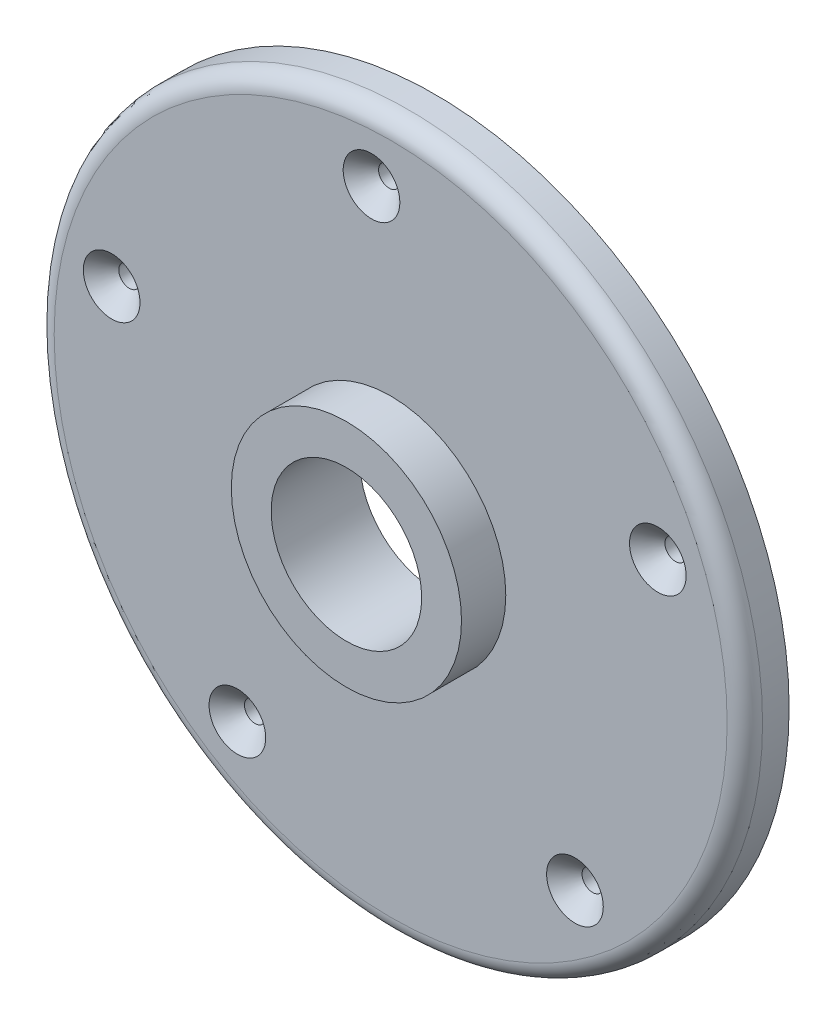
ISO-10303-21;
HEADER;
FILE_DESCRIPTION(('STEP AP214'),'2;1');
FILE_NAME('part.step','',(''),(''),'','','');
FILE_SCHEMA(('AUTOMOTIVE_DESIGN { 1 0 10303 214 1 1 1 1 }'));
ENDSEC;
DATA;
#1=APPLICATION_CONTEXT('core data for automotive mechanical design processes');
#2=APPLICATION_PROTOCOL_DEFINITION('international standard','automotive_design',2000,#1);
#3=PRODUCT_CONTEXT('',#1,'mechanical');
#4=PRODUCT('Part','Part','',(#3));
#5=PRODUCT_RELATED_PRODUCT_CATEGORY('part','',(#4));
#6=PRODUCT_DEFINITION_FORMATION('','',#4);
#7=PRODUCT_DEFINITION_CONTEXT('part definition',#1,'design');
#8=PRODUCT_DEFINITION('design','',#6,#7);
#9=PRODUCT_DEFINITION_SHAPE('','',#8);
#10=(LENGTH_UNIT() NAMED_UNIT(*) SI_UNIT(.MILLI.,.METRE.));
#11=(NAMED_UNIT(*) PLANE_ANGLE_UNIT() SI_UNIT($,.RADIAN.));
#12=(NAMED_UNIT(*) SI_UNIT($,.STERADIAN.) SOLID_ANGLE_UNIT());
#13=UNCERTAINTY_MEASURE_WITH_UNIT(LENGTH_MEASURE(1.E-05),#10,'distance_accuracy_value','');
#14=(GEOMETRIC_REPRESENTATION_CONTEXT(3) GLOBAL_UNCERTAINTY_ASSIGNED_CONTEXT((#13)) GLOBAL_UNIT_ASSIGNED_CONTEXT((#10,
#11,#12)) REPRESENTATION_CONTEXT('',''));
#15=CARTESIAN_POINT('',(0.,0.,0.));
#16=DIRECTION('',(0.,0.,1.));
#17=DIRECTION('',(1.,0.,0.));
#18=AXIS2_PLACEMENT_3D('',#15,#16,#17);
#19=CARTESIAN_POINT('',(0.,0.,2.5));
#20=DIRECTION('',(0.,0.,1.));
#21=DIRECTION('',(1.,0.,0.));
#22=AXIS2_PLACEMENT_3D('',#19,#20,#21);
#23=PLANE('',#22);
#24=CARTESIAN_POINT('',(0.,0.,2.5));
#25=DIRECTION('',(0.,0.,1.));
#26=DIRECTION('',(1.,0.,0.));
#27=AXIS2_PLACEMENT_3D('',#24,#25,#26);
#28=CIRCLE('',#27,38.);
#29=CARTESIAN_POINT('',(38.,0.,2.5));
#30=VERTEX_POINT('',#29);
#31=EDGE_CURVE('E38',#30,#30,#28,.T.);
#32=ORIENTED_EDGE('',*,*,#31,.T.);
#33=EDGE_LOOP('',(#32));
#34=FACE_BOUND('',#33,.T.);
#35=CARTESIAN_POINT('',(-2.1627854626808,32.4279564425885,2.5));
#36=DIRECTION('',(0.,0.,1.));
#37=DIRECTION('',(1.,0.,0.));
#38=AXIS2_PLACEMENT_3D('',#35,#36,#37);
#39=CIRCLE('',#38,3.2);
#40=CARTESIAN_POINT('',(1.0372145373192,32.4279564425885,2.5));
#41=VERTEX_POINT('',#40);
#42=EDGE_CURVE('E57',#41,#41,#39,.T.);
#43=ORIENTED_EDGE('',*,*,#42,.F.);
#44=EDGE_LOOP('',(#43));
#45=FACE_BOUND('',#44,.T.);
#46=CARTESIAN_POINT('',(30.1724818217038,12.0777208412413,2.5));
#47=DIRECTION('',(0.,0.,1.));
#48=DIRECTION('',(1.,0.,0.));
#49=AXIS2_PLACEMENT_3D('',#46,#47,#48);
#50=CIRCLE('',#49,3.2);
#51=CARTESIAN_POINT('',(33.3724818217038,12.0777208412413,2.5));
#52=VERTEX_POINT('',#51);
#53=EDGE_CURVE('E69',#52,#52,#50,.T.);
#54=ORIENTED_EDGE('',*,*,#53,.F.);
#55=EDGE_LOOP('',(#54));
#56=FACE_BOUND('',#55,.T.);
#57=CARTESIAN_POINT('',(20.8104047534319,-24.9635144560684,2.5));
#58=DIRECTION('',(0.,0.,1.));
#59=DIRECTION('',(1.,0.,0.));
#60=AXIS2_PLACEMENT_3D('',#57,#58,#59);
#61=CIRCLE('',#60,3.2);
#62=CARTESIAN_POINT('',(24.0104047534319,-24.9635144560684,2.5));
#63=VERTEX_POINT('',#62);
#64=EDGE_CURVE('E81',#63,#63,#61,.T.);
#65=ORIENTED_EDGE('',*,*,#64,.F.);
#66=EDGE_LOOP('',(#65));
#67=FACE_BOUND('',#66,.T.);
#68=CARTESIAN_POINT('',(-17.3109443644406,-27.5060212537408,2.5));
#69=DIRECTION('',(0.,0.,1.));
#70=DIRECTION('',(1.,0.,0.));
#71=AXIS2_PLACEMENT_3D('',#68,#69,#70);
#72=CIRCLE('',#71,3.2);
#73=CARTESIAN_POINT('',(-14.1109443644406,-27.5060212537408,2.5));
#74=VERTEX_POINT('',#73);
#75=EDGE_CURVE('E93',#74,#74,#72,.T.);
#76=ORIENTED_EDGE('',*,*,#75,.F.);
#77=EDGE_LOOP('',(#76));
#78=FACE_BOUND('',#77,.T.);
#79=CARTESIAN_POINT('',(-31.5091567480146,7.96385842597976,2.5));
#80=DIRECTION('',(0.,0.,1.));
#81=DIRECTION('',(1.,0.,0.));
#82=AXIS2_PLACEMENT_3D('',#79,#80,#81);
#83=CIRCLE('',#82,3.2);
#84=CARTESIAN_POINT('',(-28.3091567480146,7.96385842597976,2.5));
#85=VERTEX_POINT('',#84);
#86=EDGE_CURVE('E105',#85,#85,#83,.T.);
#87=ORIENTED_EDGE('',*,*,#86,.F.);
#88=EDGE_LOOP('',(#87));
#89=FACE_BOUND('',#88,.T.);
#90=CARTESIAN_POINT('',(0.,0.,2.5));
#91=DIRECTION('',(0.,0.,1.));
#92=DIRECTION('',(1.,0.,0.));
#93=AXIS2_PLACEMENT_3D('',#90,#91,#92);
#94=CIRCLE('',#93,13.);
#95=CARTESIAN_POINT('',(13.,0.,2.5));
#96=VERTEX_POINT('',#95);
#97=EDGE_CURVE('E112',#96,#96,#94,.T.);
#98=ORIENTED_EDGE('',*,*,#97,.F.);
#99=EDGE_LOOP('',(#98));
#100=FACE_BOUND('',#99,.T.);
#101=ADVANCED_FACE('F31',(#34,#45,#56,#67,#78,#89,#100),#23,.T.);
#102=CARTESIAN_POINT('',(0.,0.,-2.5));
#103=DIRECTION('',(0.,0.,1.));
#104=DIRECTION('',(1.,0.,0.));
#105=AXIS2_PLACEMENT_3D('',#102,#103,#104);
#106=PLANE('',#105);
#107=CARTESIAN_POINT('',(-31.5091567480146,7.96385842597976,-2.5));
#108=DIRECTION('',(0.,0.,1.));
#109=DIRECTION('',(1.,0.,0.));
#110=AXIS2_PLACEMENT_3D('',#107,#108,#109);
#111=CIRCLE('',#110,1.225);
#112=CARTESIAN_POINT('',(-30.2841567480146,7.96385842597976,-2.5));
#113=VERTEX_POINT('',#112);
#114=EDGE_CURVE('E108',#113,#113,#111,.T.);
#115=ORIENTED_EDGE('',*,*,#114,.T.);
#116=EDGE_LOOP('',(#115));
#117=FACE_BOUND('',#116,.T.);
#118=CARTESIAN_POINT('',(-17.3109443644406,-27.5060212537408,-2.5));
#119=DIRECTION('',(0.,0.,1.));
#120=DIRECTION('',(1.,0.,0.));
#121=AXIS2_PLACEMENT_3D('',#118,#119,#120);
#122=CIRCLE('',#121,1.225);
#123=CARTESIAN_POINT('',(-16.0859443644406,-27.5060212537408,-2.5));
#124=VERTEX_POINT('',#123);
#125=EDGE_CURVE('E96',#124,#124,#122,.T.);
#126=ORIENTED_EDGE('',*,*,#125,.T.);
#127=EDGE_LOOP('',(#126));
#128=FACE_BOUND('',#127,.T.);
#129=CARTESIAN_POINT('',(20.8104047534319,-24.9635144560684,-2.5));
#130=DIRECTION('',(0.,0.,1.));
#131=DIRECTION('',(1.,0.,0.));
#132=AXIS2_PLACEMENT_3D('',#129,#130,#131);
#133=CIRCLE('',#132,1.225);
#134=CARTESIAN_POINT('',(22.0354047534319,-24.9635144560684,-2.5));
#135=VERTEX_POINT('',#134);
#136=EDGE_CURVE('E84',#135,#135,#133,.T.);
#137=ORIENTED_EDGE('',*,*,#136,.T.);
#138=EDGE_LOOP('',(#137));
#139=FACE_BOUND('',#138,.T.);
#140=CARTESIAN_POINT('',(30.1724818217038,12.0777208412413,-2.5));
#141=DIRECTION('',(0.,0.,1.));
#142=DIRECTION('',(1.,0.,0.));
#143=AXIS2_PLACEMENT_3D('',#140,#141,#142);
#144=CIRCLE('',#143,1.225);
#145=CARTESIAN_POINT('',(31.3974818217038,12.0777208412413,-2.5));
#146=VERTEX_POINT('',#145);
#147=EDGE_CURVE('E72',#146,#146,#144,.T.);
#148=ORIENTED_EDGE('',*,*,#147,.T.);
#149=EDGE_LOOP('',(#148));
#150=FACE_BOUND('',#149,.T.);
#151=CARTESIAN_POINT('',(-2.1627854626808,32.4279564425885,-2.5));
#152=DIRECTION('',(0.,0.,1.));
#153=DIRECTION('',(1.,0.,0.));
#154=AXIS2_PLACEMENT_3D('',#151,#152,#153);
#155=CIRCLE('',#154,1.225);
#156=CARTESIAN_POINT('',(-0.937785462680803,32.4279564425885,-2.5));
#157=VERTEX_POINT('',#156);
#158=EDGE_CURVE('E60',#157,#157,#155,.T.);
#159=ORIENTED_EDGE('',*,*,#158,.T.);
#160=EDGE_LOOP('',(#159));
#161=FACE_BOUND('',#160,.T.);
#162=CARTESIAN_POINT('',(0.,0.,-2.5));
#163=DIRECTION('',(0.,0.,1.));
#164=DIRECTION('',(1.,0.,0.));
#165=AXIS2_PLACEMENT_3D('',#162,#163,#164);
#166=CIRCLE('',#165,40.);
#167=CARTESIAN_POINT('',(40.,0.,-2.5));
#168=VERTEX_POINT('',#167);
#169=EDGE_CURVE('E42',#168,#168,#166,.T.);
#170=ORIENTED_EDGE('',*,*,#169,.F.);
#171=EDGE_LOOP('',(#170));
#172=FACE_BOUND('',#171,.T.);
#173=CARTESIAN_POINT('',(0.,0.,-2.5));
#174=DIRECTION('',(0.,0.,1.));
#175=DIRECTION('',(1.,0.,0.));
#176=AXIS2_PLACEMENT_3D('',#173,#174,#175);
#177=CIRCLE('',#176,8.5);
#178=CARTESIAN_POINT('',(8.5,0.,-2.5));
#179=VERTEX_POINT('',#178);
#180=EDGE_CURVE('E46',#179,#179,#177,.T.);
#181=ORIENTED_EDGE('',*,*,#180,.T.);
#182=EDGE_LOOP('',(#181));
#183=FACE_BOUND('',#182,.T.);
#184=ADVANCED_FACE('F140',(#117,#128,#139,#150,#161,#172,#183),#106,.F.);
#185=CARTESIAN_POINT('',(0.,0.,2.5));
#186=DIRECTION('',(0.,0.,-1.));
#187=DIRECTION('',(-1.,0.,0.));
#188=AXIS2_PLACEMENT_3D('',#185,#186,#187);
#189=CYLINDRICAL_SURFACE('',#188,40.);
#190=CARTESIAN_POINT('',(0.,0.,0.5));
#191=DIRECTION('',(0.,0.,1.));
#192=DIRECTION('',(1.,0.,0.));
#193=AXIS2_PLACEMENT_3D('',#190,#191,#192);
#194=CIRCLE('',#193,40.);
#195=CARTESIAN_POINT('',(40.,0.,0.5));
#196=VERTEX_POINT('',#195);
#197=EDGE_CURVE('E10',#196,#196,#194,.F.);
#198=ORIENTED_EDGE('',*,*,#197,.T.);
#199=EDGE_LOOP('',(#198));
#200=FACE_BOUND('',#199,.T.);
#201=ORIENTED_EDGE('',*,*,#169,.T.);
#202=EDGE_LOOP('',(#201));
#203=FACE_BOUND('',#202,.T.);
#204=ADVANCED_FACE('F147',(#200,#203),#189,.T.);
#205=CARTESIAN_POINT('',(0.,0.,2.5));
#206=DIRECTION('',(0.,0.,-1.));
#207=DIRECTION('',(-1.,0.,0.));
#208=AXIS2_PLACEMENT_3D('',#205,#206,#207);
#209=CYLINDRICAL_SURFACE('',#208,8.5);
#210=ORIENTED_EDGE('',*,*,#180,.F.);
#211=EDGE_LOOP('',(#210));
#212=FACE_BOUND('',#211,.T.);
#213=CARTESIAN_POINT('',(0.,0.,7.5));
#214=DIRECTION('',(0.,0.,1.));
#215=DIRECTION('',(1.,0.,0.));
#216=AXIS2_PLACEMENT_3D('',#213,#214,#215);
#217=CIRCLE('',#216,8.5);
#218=CARTESIAN_POINT('',(8.5,0.,7.5));
#219=VERTEX_POINT('',#218);
#220=EDGE_CURVE('E115',#219,#219,#217,.T.);
#221=ORIENTED_EDGE('',*,*,#220,.T.);
#222=EDGE_LOOP('',(#221));
#223=FACE_BOUND('',#222,.T.);
#224=ADVANCED_FACE('F121',(#212,#223),#209,.F.);
#225=CARTESIAN_POINT('',(0.,0.,0.5));
#226=DIRECTION('',(0.,0.,1.));
#227=DIRECTION('',(1.,0.,0.));
#228=AXIS2_PLACEMENT_3D('',#225,#226,#227);
#229=TOROIDAL_SURFACE('',#228,38.,2.);
#230=ORIENTED_EDGE('',*,*,#197,.F.);
#231=EDGE_LOOP('',(#230));
#232=FACE_BOUND('',#231,.T.);
#233=ORIENTED_EDGE('',*,*,#31,.F.);
#234=EDGE_LOOP('',(#233));
#235=FACE_BOUND('',#234,.T.);
#236=ADVANCED_FACE('F33',(#232,#235),#229,.T.);
#237=CARTESIAN_POINT('',(-2.1627854626808,32.4279564425885,-2.475));
#238=DIRECTION('',(0.,0.,-1.));
#239=DIRECTION('',(-1.,0.,0.));
#240=AXIS2_PLACEMENT_3D('',#237,#238,#239);
#241=CONICAL_SURFACE('',#240,1.2,0.785398163397487);
#242=ORIENTED_EDGE('',*,*,#158,.F.);
#243=EDGE_LOOP('',(#242));
#244=FACE_BOUND('',#243,.T.);
#245=CARTESIAN_POINT('',(-2.1627854626808,32.4279564425885,-2.475));
#246=DIRECTION('',(0.,0.,1.));
#247=DIRECTION('',(1.,0.,0.));
#248=AXIS2_PLACEMENT_3D('',#245,#246,#247);
#249=CIRCLE('',#248,1.2);
#250=CARTESIAN_POINT('',(-0.962785462680805,32.4279564425885,-2.475));
#251=VERTEX_POINT('',#250);
#252=EDGE_CURVE('E51',#251,#251,#249,.T.);
#253=ORIENTED_EDGE('',*,*,#252,.T.);
#254=EDGE_LOOP('',(#253));
#255=FACE_BOUND('',#254,.T.);
#256=ADVANCED_FACE('F165',(#244,#255),#241,.F.);
#257=CARTESIAN_POINT('',(-2.1627854626808,32.4279564425885,2.5));
#258=DIRECTION('',(0.,0.,1.));
#259=DIRECTION('',(1.,0.,0.));
#260=AXIS2_PLACEMENT_3D('',#257,#258,#259);
#261=CYLINDRICAL_SURFACE('',#260,1.2);
#262=ORIENTED_EDGE('',*,*,#252,.F.);
#263=EDGE_LOOP('',(#262));
#264=FACE_BOUND('',#263,.T.);
#265=CARTESIAN_POINT('',(-2.1627854626808,32.4279564425885,0.500000000000001));
#266=DIRECTION('',(0.,0.,1.));
#267=DIRECTION('',(1.,0.,0.));
#268=AXIS2_PLACEMENT_3D('',#265,#266,#267);
#269=CIRCLE('',#268,1.2);
#270=CARTESIAN_POINT('',(-0.962785462680804,32.4279564425885,0.500000000000001));
#271=VERTEX_POINT('',#270);
#272=EDGE_CURVE('E54',#271,#271,#269,.T.);
#273=ORIENTED_EDGE('',*,*,#272,.T.);
#274=EDGE_LOOP('',(#273));
#275=FACE_BOUND('',#274,.T.);
#276=ADVANCED_FACE('F170',(#264,#275),#261,.F.);
#277=CARTESIAN_POINT('',(-2.1627854626808,32.4279564425885,2.5));
#278=DIRECTION('',(0.,0.,1.));
#279=DIRECTION('',(1.,0.,0.));
#280=AXIS2_PLACEMENT_3D('',#277,#278,#279);
#281=CONICAL_SURFACE('',#280,3.2,0.785398163397448);
#282=ORIENTED_EDGE('',*,*,#272,.F.);
#283=EDGE_LOOP('',(#282));
#284=FACE_BOUND('',#283,.T.);
#285=ORIENTED_EDGE('',*,*,#42,.T.);
#286=EDGE_LOOP('',(#285));
#287=FACE_BOUND('',#286,.T.);
#288=ADVANCED_FACE('F176',(#284,#287),#281,.F.);
#289=CARTESIAN_POINT('',(30.1724818217038,12.0777208412413,-2.475));
#290=DIRECTION('',(0.,0.,-1.));
#291=DIRECTION('',(-1.,0.,0.));
#292=AXIS2_PLACEMENT_3D('',#289,#290,#291);
#293=CONICAL_SURFACE('',#292,1.2,0.785398163397396);
#294=ORIENTED_EDGE('',*,*,#147,.F.);
#295=EDGE_LOOP('',(#294));
#296=FACE_BOUND('',#295,.T.);
#297=CARTESIAN_POINT('',(30.1724818217038,12.0777208412413,-2.475));
#298=DIRECTION('',(0.,0.,1.));
#299=DIRECTION('',(1.,0.,0.));
#300=AXIS2_PLACEMENT_3D('',#297,#298,#299);
#301=CIRCLE('',#300,1.2);
#302=CARTESIAN_POINT('',(31.3724818217038,12.0777208412413,-2.475));
#303=VERTEX_POINT('',#302);
#304=EDGE_CURVE('E63',#303,#303,#301,.T.);
#305=ORIENTED_EDGE('',*,*,#304,.T.);
#306=EDGE_LOOP('',(#305));
#307=FACE_BOUND('',#306,.T.);
#308=ADVANCED_FACE('F184',(#296,#307),#293,.F.);
#309=CARTESIAN_POINT('',(30.1724818217038,12.0777208412413,2.5));
#310=DIRECTION('',(0.,0.,1.));
#311=DIRECTION('',(1.,0.,0.));
#312=AXIS2_PLACEMENT_3D('',#309,#310,#311);
#313=CYLINDRICAL_SURFACE('',#312,1.2);
#314=ORIENTED_EDGE('',*,*,#304,.F.);
#315=EDGE_LOOP('',(#314));
#316=FACE_BOUND('',#315,.T.);
#317=CARTESIAN_POINT('',(30.1724818217038,12.0777208412413,0.500000000000001));
#318=DIRECTION('',(0.,0.,1.));
#319=DIRECTION('',(1.,0.,0.));
#320=AXIS2_PLACEMENT_3D('',#317,#318,#319);
#321=CIRCLE('',#320,1.2);
#322=CARTESIAN_POINT('',(31.3724818217038,12.0777208412413,0.500000000000001));
#323=VERTEX_POINT('',#322);
#324=EDGE_CURVE('E66',#323,#323,#321,.T.);
#325=ORIENTED_EDGE('',*,*,#324,.T.);
#326=EDGE_LOOP('',(#325));
#327=FACE_BOUND('',#326,.T.);
#328=ADVANCED_FACE('F188',(#316,#327),#313,.F.);
#329=CARTESIAN_POINT('',(30.1724818217038,12.0777208412413,2.5));
#330=DIRECTION('',(0.,0.,1.));
#331=DIRECTION('',(1.,0.,0.));
#332=AXIS2_PLACEMENT_3D('',#329,#330,#331);
#333=CONICAL_SURFACE('',#332,3.2,0.785398163397449);
#334=ORIENTED_EDGE('',*,*,#324,.F.);
#335=EDGE_LOOP('',(#334));
#336=FACE_BOUND('',#335,.T.);
#337=ORIENTED_EDGE('',*,*,#53,.T.);
#338=EDGE_LOOP('',(#337));
#339=FACE_BOUND('',#338,.T.);
#340=ADVANCED_FACE('F192',(#336,#339),#333,.F.);
#341=CARTESIAN_POINT('',(20.8104047534319,-24.9635144560684,-2.475));
#342=DIRECTION('',(0.,0.,-1.));
#343=DIRECTION('',(-1.,0.,0.));
#344=AXIS2_PLACEMENT_3D('',#341,#342,#343);
#345=CONICAL_SURFACE('',#344,1.2,0.785398163397466);
#346=ORIENTED_EDGE('',*,*,#136,.F.);
#347=EDGE_LOOP('',(#346));
#348=FACE_BOUND('',#347,.T.);
#349=CARTESIAN_POINT('',(20.8104047534319,-24.9635144560684,-2.475));
#350=DIRECTION('',(0.,0.,1.));
#351=DIRECTION('',(1.,0.,0.));
#352=AXIS2_PLACEMENT_3D('',#349,#350,#351);
#353=CIRCLE('',#352,1.2);
#354=CARTESIAN_POINT('',(22.0104047534319,-24.9635144560684,-2.475));
#355=VERTEX_POINT('',#354);
#356=EDGE_CURVE('E75',#355,#355,#353,.T.);
#357=ORIENTED_EDGE('',*,*,#356,.T.);
#358=EDGE_LOOP('',(#357));
#359=FACE_BOUND('',#358,.T.);
#360=ADVANCED_FACE('F196',(#348,#359),#345,.F.);
#361=CARTESIAN_POINT('',(20.8104047534319,-24.9635144560684,2.5));
#362=DIRECTION('',(0.,0.,1.));
#363=DIRECTION('',(1.,0.,0.));
#364=AXIS2_PLACEMENT_3D('',#361,#362,#363);
#365=CYLINDRICAL_SURFACE('',#364,1.2);
#366=ORIENTED_EDGE('',*,*,#356,.F.);
#367=EDGE_LOOP('',(#366));
#368=FACE_BOUND('',#367,.T.);
#369=CARTESIAN_POINT('',(20.8104047534319,-24.9635144560684,0.500000000000001));
#370=DIRECTION('',(0.,0.,1.));
#371=DIRECTION('',(1.,0.,0.));
#372=AXIS2_PLACEMENT_3D('',#369,#370,#371);
#373=CIRCLE('',#372,1.2);
#374=CARTESIAN_POINT('',(22.0104047534319,-24.9635144560684,0.500000000000001));
#375=VERTEX_POINT('',#374);
#376=EDGE_CURVE('E78',#375,#375,#373,.T.);
#377=ORIENTED_EDGE('',*,*,#376,.T.);
#378=EDGE_LOOP('',(#377));
#379=FACE_BOUND('',#378,.T.);
#380=ADVANCED_FACE('F200',(#368,#379),#365,.F.);
#381=CARTESIAN_POINT('',(20.8104047534319,-24.9635144560684,2.5));
#382=DIRECTION('',(0.,0.,1.));
#383=DIRECTION('',(1.,0.,0.));
#384=AXIS2_PLACEMENT_3D('',#381,#382,#383);
#385=CONICAL_SURFACE('',#384,3.2,0.785398163397448);
#386=ORIENTED_EDGE('',*,*,#376,.F.);
#387=EDGE_LOOP('',(#386));
#388=FACE_BOUND('',#387,.T.);
#389=ORIENTED_EDGE('',*,*,#64,.T.);
#390=EDGE_LOOP('',(#389));
#391=FACE_BOUND('',#390,.T.);
#392=ADVANCED_FACE('F204',(#388,#391),#385,.F.);
#393=CARTESIAN_POINT('',(-17.3109443644406,-27.5060212537408,-2.475));
#394=DIRECTION('',(0.,0.,-1.));
#395=DIRECTION('',(-1.,0.,0.));
#396=AXIS2_PLACEMENT_3D('',#393,#394,#395);
#397=CONICAL_SURFACE('',#396,1.2,0.785398163397466);
#398=ORIENTED_EDGE('',*,*,#125,.F.);
#399=EDGE_LOOP('',(#398));
#400=FACE_BOUND('',#399,.T.);
#401=CARTESIAN_POINT('',(-17.3109443644406,-27.5060212537408,-2.475));
#402=DIRECTION('',(0.,0.,1.));
#403=DIRECTION('',(1.,0.,0.));
#404=AXIS2_PLACEMENT_3D('',#401,#402,#403);
#405=CIRCLE('',#404,1.2);
#406=CARTESIAN_POINT('',(-16.1109443644406,-27.5060212537408,-2.475));
#407=VERTEX_POINT('',#406);
#408=EDGE_CURVE('E87',#407,#407,#405,.T.);
#409=ORIENTED_EDGE('',*,*,#408,.T.);
#410=EDGE_LOOP('',(#409));
#411=FACE_BOUND('',#410,.T.);
#412=ADVANCED_FACE('F208',(#400,#411),#397,.F.);
#413=CARTESIAN_POINT('',(-17.3109443644406,-27.5060212537408,2.5));
#414=DIRECTION('',(0.,0.,1.));
#415=DIRECTION('',(1.,0.,0.));
#416=AXIS2_PLACEMENT_3D('',#413,#414,#415);
#417=CYLINDRICAL_SURFACE('',#416,1.2);
#418=ORIENTED_EDGE('',*,*,#408,.F.);
#419=EDGE_LOOP('',(#418));
#420=FACE_BOUND('',#419,.T.);
#421=CARTESIAN_POINT('',(-17.3109443644406,-27.5060212537408,0.500000000000001));
#422=DIRECTION('',(0.,0.,1.));
#423=DIRECTION('',(1.,0.,0.));
#424=AXIS2_PLACEMENT_3D('',#421,#422,#423);
#425=CIRCLE('',#424,1.2);
#426=CARTESIAN_POINT('',(-16.1109443644406,-27.5060212537408,0.500000000000001));
#427=VERTEX_POINT('',#426);
#428=EDGE_CURVE('E90',#427,#427,#425,.T.);
#429=ORIENTED_EDGE('',*,*,#428,.T.);
#430=EDGE_LOOP('',(#429));
#431=FACE_BOUND('',#430,.T.);
#432=ADVANCED_FACE('F212',(#420,#431),#417,.F.);
#433=CARTESIAN_POINT('',(-17.3109443644406,-27.5060212537408,2.5));
#434=DIRECTION('',(0.,0.,1.));
#435=DIRECTION('',(1.,0.,0.));
#436=AXIS2_PLACEMENT_3D('',#433,#434,#435);
#437=CONICAL_SURFACE('',#436,3.2,0.785398163397448);
#438=ORIENTED_EDGE('',*,*,#428,.F.);
#439=EDGE_LOOP('',(#438));
#440=FACE_BOUND('',#439,.T.);
#441=ORIENTED_EDGE('',*,*,#75,.T.);
#442=EDGE_LOOP('',(#441));
#443=FACE_BOUND('',#442,.T.);
#444=ADVANCED_FACE('F216',(#440,#443),#437,.F.);
#445=CARTESIAN_POINT('',(-31.5091567480146,7.96385842597976,-2.475));
#446=DIRECTION('',(0.,0.,-1.));
#447=DIRECTION('',(-1.,0.,0.));
#448=AXIS2_PLACEMENT_3D('',#445,#446,#447);
#449=CONICAL_SURFACE('',#448,1.2,0.785398163397466);
#450=ORIENTED_EDGE('',*,*,#114,.F.);
#451=EDGE_LOOP('',(#450));
#452=FACE_BOUND('',#451,.T.);
#453=CARTESIAN_POINT('',(-31.5091567480146,7.96385842597976,-2.475));
#454=DIRECTION('',(0.,0.,1.));
#455=DIRECTION('',(1.,0.,0.));
#456=AXIS2_PLACEMENT_3D('',#453,#454,#455);
#457=CIRCLE('',#456,1.2);
#458=CARTESIAN_POINT('',(-30.3091567480146,7.96385842597976,-2.475));
#459=VERTEX_POINT('',#458);
#460=EDGE_CURVE('E99',#459,#459,#457,.T.);
#461=ORIENTED_EDGE('',*,*,#460,.T.);
#462=EDGE_LOOP('',(#461));
#463=FACE_BOUND('',#462,.T.);
#464=ADVANCED_FACE('F220',(#452,#463),#449,.F.);
#465=CARTESIAN_POINT('',(-31.5091567480146,7.96385842597976,2.5));
#466=DIRECTION('',(0.,0.,1.));
#467=DIRECTION('',(1.,0.,0.));
#468=AXIS2_PLACEMENT_3D('',#465,#466,#467);
#469=CYLINDRICAL_SURFACE('',#468,1.2);
#470=ORIENTED_EDGE('',*,*,#460,.F.);
#471=EDGE_LOOP('',(#470));
#472=FACE_BOUND('',#471,.T.);
#473=CARTESIAN_POINT('',(-31.5091567480146,7.96385842597976,0.500000000000001));
#474=DIRECTION('',(0.,0.,1.));
#475=DIRECTION('',(1.,0.,0.));
#476=AXIS2_PLACEMENT_3D('',#473,#474,#475);
#477=CIRCLE('',#476,1.2);
#478=CARTESIAN_POINT('',(-30.3091567480146,7.96385842597976,0.500000000000001));
#479=VERTEX_POINT('',#478);
#480=EDGE_CURVE('E102',#479,#479,#477,.T.);
#481=ORIENTED_EDGE('',*,*,#480,.T.);
#482=EDGE_LOOP('',(#481));
#483=FACE_BOUND('',#482,.T.);
#484=ADVANCED_FACE('F136',(#472,#483),#469,.F.);
#485=CARTESIAN_POINT('',(-31.5091567480146,7.96385842597976,2.5));
#486=DIRECTION('',(0.,0.,1.));
#487=DIRECTION('',(1.,0.,0.));
#488=AXIS2_PLACEMENT_3D('',#485,#486,#487);
#489=CONICAL_SURFACE('',#488,3.2,0.785398163397449);
#490=ORIENTED_EDGE('',*,*,#480,.F.);
#491=EDGE_LOOP('',(#490));
#492=FACE_BOUND('',#491,.T.);
#493=ORIENTED_EDGE('',*,*,#86,.T.);
#494=EDGE_LOOP('',(#493));
#495=FACE_BOUND('',#494,.T.);
#496=ADVANCED_FACE('F126',(#492,#495),#489,.F.);
#497=CARTESIAN_POINT('',(0.,0.,7.5));
#498=DIRECTION('',(0.,0.,1.));
#499=DIRECTION('',(1.,0.,0.));
#500=AXIS2_PLACEMENT_3D('',#497,#498,#499);
#501=PLANE('',#500);
#502=CARTESIAN_POINT('',(0.,0.,7.5));
#503=DIRECTION('',(0.,0.,1.));
#504=DIRECTION('',(1.,0.,0.));
#505=AXIS2_PLACEMENT_3D('',#502,#503,#504);
#506=CIRCLE('',#505,13.);
#507=CARTESIAN_POINT('',(13.,0.,7.5));
#508=VERTEX_POINT('',#507);
#509=EDGE_CURVE('E111',#508,#508,#506,.T.);
#510=ORIENTED_EDGE('',*,*,#509,.T.);
#511=EDGE_LOOP('',(#510));
#512=FACE_BOUND('',#511,.T.);
#513=ORIENTED_EDGE('',*,*,#220,.F.);
#514=EDGE_LOOP('',(#513));
#515=FACE_BOUND('',#514,.T.);
#516=ADVANCED_FACE('F123',(#512,#515),#501,.T.);
#517=CARTESIAN_POINT('',(0.,0.,7.5));
#518=DIRECTION('',(0.,0.,-1.));
#519=DIRECTION('',(-1.,0.,0.));
#520=AXIS2_PLACEMENT_3D('',#517,#518,#519);
#521=CYLINDRICAL_SURFACE('',#520,13.);
#522=ORIENTED_EDGE('',*,*,#509,.F.);
#523=EDGE_LOOP('',(#522));
#524=FACE_BOUND('',#523,.T.);
#525=ORIENTED_EDGE('',*,*,#97,.T.);
#526=EDGE_LOOP('',(#525));
#527=FACE_BOUND('',#526,.T.);
#528=ADVANCED_FACE('F125',(#524,#527),#521,.T.);
#529=CLOSED_SHELL('',(#101,#184,#204,#224,#236,#256,#276,#288,#308,#328,#340,#360,#380,#392,
#412,#432,#444,#464,#484,#496,#516,#528));
#530=MANIFOLD_SOLID_BREP('B2',#529);
#531=ADVANCED_BREP_SHAPE_REPRESENTATION('',(#18,#530),#14);
#532=SHAPE_DEFINITION_REPRESENTATION(#9,#531);
ENDSEC;
END-ISO-10303-21;
